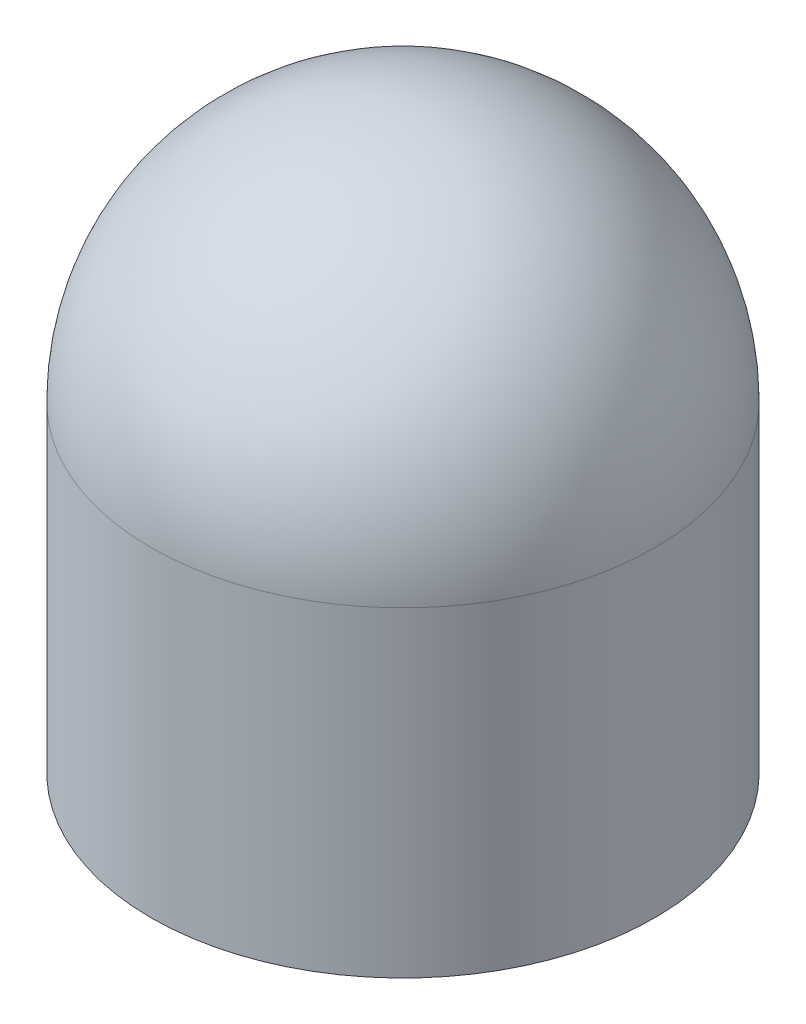
ISO-10303-21;
HEADER;
FILE_DESCRIPTION(('STEP AP214'),'2;1');
FILE_NAME('part.step','',(''),(''),'','','');
FILE_SCHEMA(('AUTOMOTIVE_DESIGN { 1 0 10303 214 1 1 1 1 }'));
ENDSEC;
DATA;
#1=APPLICATION_CONTEXT('core data for automotive mechanical design processes');
#2=APPLICATION_PROTOCOL_DEFINITION('international standard','automotive_design',2000,#1);
#3=PRODUCT_CONTEXT('',#1,'mechanical');
#4=PRODUCT('Part','Part','',(#3));
#5=PRODUCT_RELATED_PRODUCT_CATEGORY('part','',(#4));
#6=PRODUCT_DEFINITION_FORMATION('','',#4);
#7=PRODUCT_DEFINITION_CONTEXT('part definition',#1,'design');
#8=PRODUCT_DEFINITION('design','',#6,#7);
#9=PRODUCT_DEFINITION_SHAPE('','',#8);
#10=(LENGTH_UNIT() NAMED_UNIT(*) SI_UNIT(.MILLI.,.METRE.));
#11=(NAMED_UNIT(*) PLANE_ANGLE_UNIT() SI_UNIT($,.RADIAN.));
#12=(NAMED_UNIT(*) SI_UNIT($,.STERADIAN.) SOLID_ANGLE_UNIT());
#13=UNCERTAINTY_MEASURE_WITH_UNIT(LENGTH_MEASURE(1.E-05),#10,'distance_accuracy_value','');
#14=(GEOMETRIC_REPRESENTATION_CONTEXT(3) GLOBAL_UNCERTAINTY_ASSIGNED_CONTEXT((#13)) GLOBAL_UNIT_ASSIGNED_CONTEXT((#10,
#11,#12)) REPRESENTATION_CONTEXT('',''));
#15=CARTESIAN_POINT('',(0.,0.,0.));
#16=DIRECTION('',(0.,0.,1.));
#17=DIRECTION('',(1.,0.,0.));
#18=AXIS2_PLACEMENT_3D('',#15,#16,#17);
#19=CARTESIAN_POINT('',(0.,146.05,0.));
#20=DIRECTION('',(0.,1.,0.));
#21=DIRECTION('',(0.,0.,1.));
#22=AXIS2_PLACEMENT_3D('',#19,#20,#21);
#23=CYLINDRICAL_SURFACE('',#22,69.85);
#24=CARTESIAN_POINT('',(0.,76.2,0.));
#25=DIRECTION('',(0.,1.,0.));
#26=DIRECTION('',(0.,0.,1.));
#27=AXIS2_PLACEMENT_3D('',#24,#25,#26);
#28=CIRCLE('',#27,69.85);
#29=CARTESIAN_POINT('',(0.,76.2,69.85));
#30=VERTEX_POINT('',#29);
#31=EDGE_CURVE('E10',#30,#30,#28,.T.);
#32=ORIENTED_EDGE('',*,*,#31,.F.);
#33=EDGE_LOOP('',(#32));
#34=FACE_BOUND('',#33,.T.);
#35=CARTESIAN_POINT('',(0.,-12.7,0.));
#36=DIRECTION('',(0.,1.,0.));
#37=DIRECTION('',(0.,0.,1.));
#38=AXIS2_PLACEMENT_3D('',#35,#36,#37);
#39=CIRCLE('',#38,69.85);
#40=CARTESIAN_POINT('',(0.,-12.7,69.85));
#41=VERTEX_POINT('',#40);
#42=EDGE_CURVE('E53',#41,#41,#39,.T.);
#43=ORIENTED_EDGE('',*,*,#42,.T.);
#44=EDGE_LOOP('',(#43));
#45=FACE_BOUND('',#44,.T.);
#46=ADVANCED_FACE('F34',(#34,#45),#23,.T.);
#47=CARTESIAN_POINT('',(0.,76.2,0.));
#48=DIRECTION('',(0.,1.,0.));
#49=DIRECTION('',(1.,0.,0.));
#50=AXIS2_PLACEMENT_3D('',#47,#48,#49);
#51=SPHERICAL_SURFACE('',#50,69.85);
#52=ORIENTED_EDGE('',*,*,#31,.T.);
#53=EDGE_LOOP('',(#52));
#54=FACE_BOUND('',#53,.T.);
#55=ADVANCED_FACE('F84',(#54),#51,.T.);
#56=CARTESIAN_POINT('',(0.,146.05,0.));
#57=DIRECTION('',(0.,1.,0.));
#58=DIRECTION('',(0.,0.,1.));
#59=AXIS2_PLACEMENT_3D('',#56,#57,#58);
#60=CYLINDRICAL_SURFACE('',#59,66.675);
#61=CARTESIAN_POINT('',(0.,-11.1125,0.));
#62=DIRECTION('',(0.,-1.,0.));
#63=DIRECTION('',(0.,0.,-1.));
#64=AXIS2_PLACEMENT_3D('',#61,#62,#63);
#65=CIRCLE('',#64,66.675);
#66=CARTESIAN_POINT('',(0.,-11.1125,-66.675));
#67=VERTEX_POINT('',#66);
#68=EDGE_CURVE('E56',#67,#67,#65,.T.);
#69=ORIENTED_EDGE('',*,*,#68,.F.);
#70=EDGE_LOOP('',(#69));
#71=FACE_BOUND('',#70,.T.);
#72=CARTESIAN_POINT('',(0.,-12.7,0.));
#73=DIRECTION('',(0.,1.,0.));
#74=DIRECTION('',(0.,0.,1.));
#75=AXIS2_PLACEMENT_3D('',#72,#73,#74);
#76=CIRCLE('',#75,66.675);
#77=CARTESIAN_POINT('',(0.,-12.7,66.675));
#78=VERTEX_POINT('',#77);
#79=EDGE_CURVE('E48',#78,#78,#76,.T.);
#80=ORIENTED_EDGE('',*,*,#79,.F.);
#81=EDGE_LOOP('',(#80));
#82=FACE_BOUND('',#81,.T.);
#83=ADVANCED_FACE('F80',(#71,#82),#60,.F.);
#84=CARTESIAN_POINT('',(0.,-12.7,0.));
#85=DIRECTION('',(0.,-1.,0.));
#86=DIRECTION('',(0.,0.,-1.));
#87=AXIS2_PLACEMENT_3D('',#84,#85,#86);
#88=PLANE('',#87);
#89=ORIENTED_EDGE('',*,*,#79,.T.);
#90=EDGE_LOOP('',(#89));
#91=FACE_BOUND('',#90,.T.);
#92=ORIENTED_EDGE('',*,*,#42,.F.);
#93=EDGE_LOOP('',(#92));
#94=FACE_BOUND('',#93,.T.);
#95=ADVANCED_FACE('F71',(#91,#94),#88,.T.);
#96=CARTESIAN_POINT('',(0.,-11.1125,0.));
#97=DIRECTION('',(0.,-1.,0.));
#98=DIRECTION('',(0.,0.,-1.));
#99=AXIS2_PLACEMENT_3D('',#96,#97,#98);
#100=PLANE('',#99);
#101=ORIENTED_EDGE('',*,*,#68,.T.);
#102=EDGE_LOOP('',(#101));
#103=FACE_BOUND('',#102,.T.);
#104=CARTESIAN_POINT('',(0.,-11.1125,0.));
#105=DIRECTION('',(0.,-1.,0.));
#106=DIRECTION('',(0.,0.,-1.));
#107=AXIS2_PLACEMENT_3D('',#104,#105,#106);
#108=CIRCLE('',#107,65.0875);
#109=CARTESIAN_POINT('',(0.,-11.1125,-65.0875));
#110=VERTEX_POINT('',#109);
#111=EDGE_CURVE('E59',#110,#110,#108,.T.);
#112=ORIENTED_EDGE('',*,*,#111,.F.);
#113=EDGE_LOOP('',(#112));
#114=FACE_BOUND('',#113,.T.);
#115=ADVANCED_FACE('F69',(#103,#114),#100,.T.);
#116=CARTESIAN_POINT('',(0.,-11.1125,0.));
#117=DIRECTION('',(0.,1.,0.));
#118=DIRECTION('',(0.,0.,1.));
#119=AXIS2_PLACEMENT_3D('',#116,#117,#118);
#120=CYLINDRICAL_SURFACE('',#119,65.0875);
#121=ORIENTED_EDGE('',*,*,#111,.T.);
#122=EDGE_LOOP('',(#121));
#123=FACE_BOUND('',#122,.T.);
#124=CARTESIAN_POINT('',(0.,0.,0.));
#125=DIRECTION('',(0.,-1.,0.));
#126=DIRECTION('',(0.,0.,-1.));
#127=AXIS2_PLACEMENT_3D('',#124,#125,#126);
#128=CIRCLE('',#127,65.0875);
#129=CARTESIAN_POINT('',(0.,0.,-65.0875));
#130=VERTEX_POINT('',#129);
#131=EDGE_CURVE('E60',#130,#130,#128,.T.);
#132=ORIENTED_EDGE('',*,*,#131,.F.);
#133=EDGE_LOOP('',(#132));
#134=FACE_BOUND('',#133,.T.);
#135=ADVANCED_FACE('F66',(#123,#134),#120,.F.);
#136=CARTESIAN_POINT('',(0.,76.2,0.));
#137=DIRECTION('',(0.,1.,0.));
#138=DIRECTION('',(1.,0.,0.));
#139=AXIS2_PLACEMENT_3D('',#136,#137,#138);
#140=SPHERICAL_SURFACE('',#139,63.5);
#141=CARTESIAN_POINT('',(0.,76.2,0.));
#142=DIRECTION('',(0.,1.,0.));
#143=DIRECTION('',(0.,0.,1.));
#144=AXIS2_PLACEMENT_3D('',#141,#142,#143);
#145=CIRCLE('',#144,63.5);
#146=CARTESIAN_POINT('',(0.,76.2,63.5));
#147=VERTEX_POINT('',#146);
#148=EDGE_CURVE('E40',#147,#147,#145,.T.);
#149=ORIENTED_EDGE('',*,*,#148,.F.);
#150=EDGE_LOOP('',(#149));
#151=FACE_BOUND('',#150,.T.);
#152=ADVANCED_FACE('F78',(#151),#140,.F.);
#153=CARTESIAN_POINT('',(0.,146.05,0.));
#154=DIRECTION('',(0.,1.,0.));
#155=DIRECTION('',(0.,0.,1.));
#156=AXIS2_PLACEMENT_3D('',#153,#154,#155);
#157=CYLINDRICAL_SURFACE('',#156,63.5);
#158=CARTESIAN_POINT('',(0.,0.,0.));
#159=DIRECTION('',(0.,1.,0.));
#160=DIRECTION('',(0.,0.,1.));
#161=AXIS2_PLACEMENT_3D('',#158,#159,#160);
#162=CIRCLE('',#161,63.5);
#163=CARTESIAN_POINT('',(0.,0.,63.5));
#164=VERTEX_POINT('',#163);
#165=EDGE_CURVE('E44',#164,#164,#162,.T.);
#166=ORIENTED_EDGE('',*,*,#165,.F.);
#167=EDGE_LOOP('',(#166));
#168=FACE_BOUND('',#167,.T.);
#169=ORIENTED_EDGE('',*,*,#148,.T.);
#170=EDGE_LOOP('',(#169));
#171=FACE_BOUND('',#170,.T.);
#172=ADVANCED_FACE('F100',(#168,#171),#157,.F.);
#173=CARTESIAN_POINT('',(0.,0.,0.));
#174=DIRECTION('',(0.,1.,0.));
#175=DIRECTION('',(0.,0.,1.));
#176=AXIS2_PLACEMENT_3D('',#173,#174,#175);
#177=PLANE('',#176);
#178=ORIENTED_EDGE('',*,*,#131,.T.);
#179=EDGE_LOOP('',(#178));
#180=FACE_BOUND('',#179,.T.);
#181=ORIENTED_EDGE('',*,*,#165,.T.);
#182=EDGE_LOOP('',(#181));
#183=FACE_BOUND('',#182,.T.);
#184=ADVANCED_FACE('F104',(#180,#183),#177,.F.);
#185=CLOSED_SHELL('',(#46,#55,#83,#95,#115,#135,#152,#172,#184));
#186=MANIFOLD_SOLID_BREP('B2',#185);
#187=ADVANCED_BREP_SHAPE_REPRESENTATION('',(#18,#186),#14);
#188=SHAPE_DEFINITION_REPRESENTATION(#9,#187);
ENDSEC;
END-ISO-10303-21;
